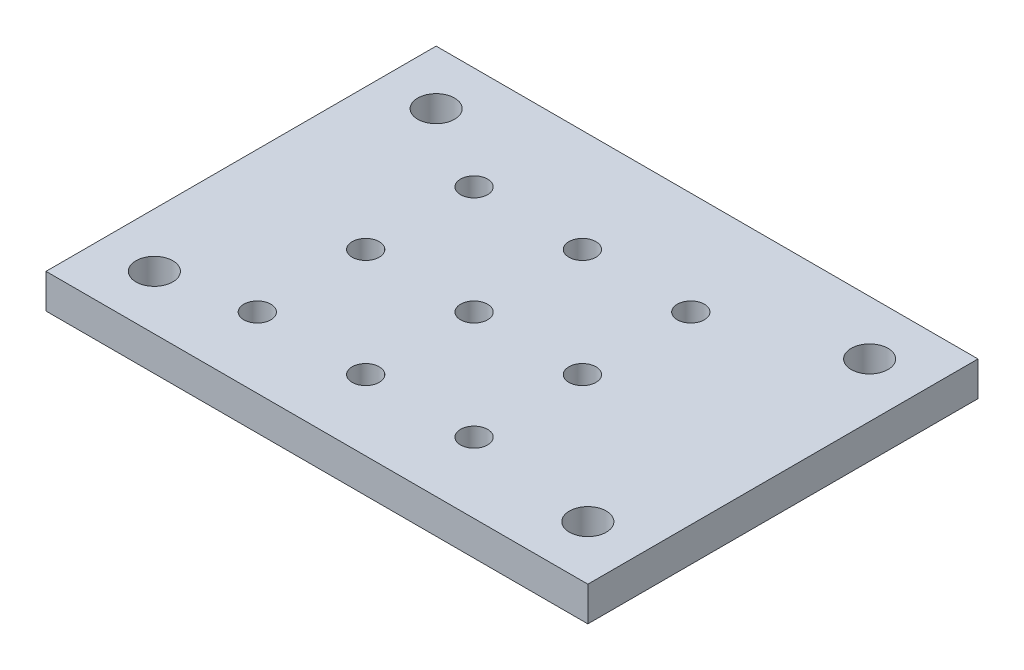
ISO-10303-21;
HEADER;
FILE_DESCRIPTION(('STEP AP214'),'2;1');
FILE_NAME('part.step','',(''),(''),'','','');
FILE_SCHEMA(('AUTOMOTIVE_DESIGN { 1 0 10303 214 1 1 1 1 }'));
ENDSEC;
DATA;
#1=APPLICATION_CONTEXT('core data for automotive mechanical design processes');
#2=APPLICATION_PROTOCOL_DEFINITION('international standard','automotive_design',2000,#1);
#3=PRODUCT_CONTEXT('',#1,'mechanical');
#4=PRODUCT('Part','Part','',(#3));
#5=PRODUCT_RELATED_PRODUCT_CATEGORY('part','',(#4));
#6=PRODUCT_DEFINITION_FORMATION('','',#4);
#7=PRODUCT_DEFINITION_CONTEXT('part definition',#1,'design');
#8=PRODUCT_DEFINITION('design','',#6,#7);
#9=PRODUCT_DEFINITION_SHAPE('','',#8);
#10=(LENGTH_UNIT() NAMED_UNIT(*) SI_UNIT(.MILLI.,.METRE.));
#11=(NAMED_UNIT(*) PLANE_ANGLE_UNIT() SI_UNIT($,.RADIAN.));
#12=(NAMED_UNIT(*) SI_UNIT($,.STERADIAN.) SOLID_ANGLE_UNIT());
#13=UNCERTAINTY_MEASURE_WITH_UNIT(LENGTH_MEASURE(1.E-05),#10,'distance_accuracy_value','');
#14=(GEOMETRIC_REPRESENTATION_CONTEXT(3) GLOBAL_UNCERTAINTY_ASSIGNED_CONTEXT((#13)) GLOBAL_UNIT_ASSIGNED_CONTEXT((#10,
#11,#12)) REPRESENTATION_CONTEXT('',''));
#15=CARTESIAN_POINT('',(0.,0.,0.));
#16=DIRECTION('',(0.,0.,1.));
#17=DIRECTION('',(1.,0.,0.));
#18=AXIS2_PLACEMENT_3D('',#15,#16,#17);
#19=CARTESIAN_POINT('',(0.,3.175,0.));
#20=DIRECTION('',(0.,0.,-1.));
#21=DIRECTION('',(-1.,0.,0.));
#22=AXIS2_PLACEMENT_3D('',#19,#20,#21);
#23=PLANE('',#22);
#24=DIRECTION('',(1.,0.,0.));
#25=VECTOR('',#24,1.);
#26=CARTESIAN_POINT('',(0.,0.,0.));
#27=LINE('',#26,#25);
#28=CARTESIAN_POINT('',(0.,0.,0.));
#29=VERTEX_POINT('',#28);
#30=CARTESIAN_POINT('',(50.,0.,0.));
#31=VERTEX_POINT('',#30);
#32=EDGE_CURVE('E168',#29,#31,#27,.T.);
#33=ORIENTED_EDGE('',*,*,#32,.T.);
#34=DIRECTION('',(0.,-1.,0.));
#35=VECTOR('',#34,1.);
#36=CARTESIAN_POINT('',(50.,3.175,0.));
#37=LINE('',#36,#35);
#38=CARTESIAN_POINT('',(50.,3.175,0.));
#39=VERTEX_POINT('',#38);
#40=EDGE_CURVE('E11',#39,#31,#37,.T.);
#41=ORIENTED_EDGE('',*,*,#40,.F.);
#42=DIRECTION('',(1.,0.,0.));
#43=VECTOR('',#42,1.);
#44=CARTESIAN_POINT('',(0.,3.175,0.));
#45=LINE('',#44,#43);
#46=CARTESIAN_POINT('',(0.,3.175,0.));
#47=VERTEX_POINT('',#46);
#48=EDGE_CURVE('E98',#47,#39,#45,.T.);
#49=ORIENTED_EDGE('',*,*,#48,.F.);
#50=DIRECTION('',(0.,-1.,0.));
#51=VECTOR('',#50,1.);
#52=CARTESIAN_POINT('',(0.,3.175,0.));
#53=LINE('',#52,#51);
#54=EDGE_CURVE('E65',#47,#29,#53,.T.);
#55=ORIENTED_EDGE('',*,*,#54,.T.);
#56=EDGE_LOOP('',(#33,#41,#49,#55));
#57=FACE_BOUND('',#56,.T.);
#58=ADVANCED_FACE('F47',(#57),#23,.F.);
#59=CARTESIAN_POINT('',(50.,3.175,0.));
#60=DIRECTION('',(-1.,0.,0.));
#61=DIRECTION('',(0.,0.,1.));
#62=AXIS2_PLACEMENT_3D('',#59,#60,#61);
#63=PLANE('',#62);
#64=DIRECTION('',(0.,0.,-1.));
#65=VECTOR('',#64,1.);
#66=CARTESIAN_POINT('',(50.,0.,0.));
#67=LINE('',#66,#65);
#68=CARTESIAN_POINT('',(50.,0.,-36.));
#69=VERTEX_POINT('',#68);
#70=EDGE_CURVE('E104',#31,#69,#67,.T.);
#71=ORIENTED_EDGE('',*,*,#70,.T.);
#72=DIRECTION('',(0.,-1.,0.));
#73=VECTOR('',#72,1.);
#74=CARTESIAN_POINT('',(50.,3.175,-36.));
#75=LINE('',#74,#73);
#76=CARTESIAN_POINT('',(50.,3.175,-36.));
#77=VERTEX_POINT('',#76);
#78=EDGE_CURVE('E57',#77,#69,#75,.T.);
#79=ORIENTED_EDGE('',*,*,#78,.F.);
#80=DIRECTION('',(0.,0.,-1.));
#81=VECTOR('',#80,1.);
#82=CARTESIAN_POINT('',(50.,3.175,0.));
#83=LINE('',#82,#81);
#84=EDGE_CURVE('E90',#39,#77,#83,.T.);
#85=ORIENTED_EDGE('',*,*,#84,.F.);
#86=ORIENTED_EDGE('',*,*,#40,.T.);
#87=EDGE_LOOP('',(#71,#79,#85,#86));
#88=FACE_BOUND('',#87,.T.);
#89=ADVANCED_FACE('F103',(#88),#63,.F.);
#90=CARTESIAN_POINT('',(0.,3.175,-36.));
#91=DIRECTION('',(0.,0.,-1.));
#92=DIRECTION('',(-1.,0.,0.));
#93=AXIS2_PLACEMENT_3D('',#90,#91,#92);
#94=PLANE('',#93);
#95=DIRECTION('',(1.,0.,0.));
#96=VECTOR('',#95,1.);
#97=CARTESIAN_POINT('',(0.,0.,-36.));
#98=LINE('',#97,#96);
#99=CARTESIAN_POINT('',(0.,0.,-36.));
#100=VERTEX_POINT('',#99);
#101=EDGE_CURVE('E173',#100,#69,#98,.T.);
#102=ORIENTED_EDGE('',*,*,#101,.F.);
#103=DIRECTION('',(0.,-1.,0.));
#104=VECTOR('',#103,1.);
#105=CARTESIAN_POINT('',(0.,3.175,-36.));
#106=LINE('',#105,#104);
#107=CARTESIAN_POINT('',(0.,3.175,-36.));
#108=VERTEX_POINT('',#107);
#109=EDGE_CURVE('E79',#108,#100,#106,.T.);
#110=ORIENTED_EDGE('',*,*,#109,.F.);
#111=DIRECTION('',(1.,0.,0.));
#112=VECTOR('',#111,1.);
#113=CARTESIAN_POINT('',(0.,3.175,-36.));
#114=LINE('',#113,#112);
#115=EDGE_CURVE('E97',#108,#77,#114,.T.);
#116=ORIENTED_EDGE('',*,*,#115,.T.);
#117=ORIENTED_EDGE('',*,*,#78,.T.);
#118=EDGE_LOOP('',(#102,#110,#116,#117));
#119=FACE_BOUND('',#118,.T.);
#120=ADVANCED_FACE('F108',(#119),#94,.T.);
#121=CARTESIAN_POINT('',(13.,3.175,-6.5));
#122=DIRECTION('',(0.,-1.,0.));
#123=DIRECTION('',(0.,0.,-1.));
#124=AXIS2_PLACEMENT_3D('',#121,#122,#123);
#125=CYLINDRICAL_SURFACE('',#124,1.25);
#126=CARTESIAN_POINT('',(13.,3.175,-6.5));
#127=DIRECTION('',(0.,1.,0.));
#128=DIRECTION('',(0.,0.,1.));
#129=AXIS2_PLACEMENT_3D('',#126,#127,#128);
#130=CIRCLE('',#129,1.25);
#131=CARTESIAN_POINT('',(13.,3.175,-5.24999999999999));
#132=VERTEX_POINT('',#131);
#133=EDGE_CURVE('E235',#132,#132,#130,.T.);
#134=ORIENTED_EDGE('',*,*,#133,.T.);
#135=EDGE_LOOP('',(#134));
#136=FACE_BOUND('',#135,.T.);
#137=CARTESIAN_POINT('',(13.,0.,-6.5));
#138=DIRECTION('',(0.,1.,0.));
#139=DIRECTION('',(0.,0.,1.));
#140=AXIS2_PLACEMENT_3D('',#137,#138,#139);
#141=CIRCLE('',#140,1.25);
#142=CARTESIAN_POINT('',(13.,0.,-5.24999999999999));
#143=VERTEX_POINT('',#142);
#144=EDGE_CURVE('E164',#143,#143,#141,.T.);
#145=ORIENTED_EDGE('',*,*,#144,.F.);
#146=EDGE_LOOP('',(#145));
#147=FACE_BOUND('',#146,.T.);
#148=ADVANCED_FACE('F241',(#136,#147),#125,.F.);
#149=CARTESIAN_POINT('',(5.,3.175,-5.));
#150=DIRECTION('',(0.,-1.,0.));
#151=DIRECTION('',(0.,0.,-1.));
#152=AXIS2_PLACEMENT_3D('',#149,#150,#151);
#153=CYLINDRICAL_SURFACE('',#152,1.7);
#154=CARTESIAN_POINT('',(5.,3.175,-5.));
#155=DIRECTION('',(0.,1.,0.));
#156=DIRECTION('',(0.,0.,1.));
#157=AXIS2_PLACEMENT_3D('',#154,#155,#156);
#158=CIRCLE('',#157,1.7);
#159=CARTESIAN_POINT('',(5.,3.175,-3.3));
#160=VERTEX_POINT('',#159);
#161=EDGE_CURVE('E231',#160,#160,#158,.T.);
#162=ORIENTED_EDGE('',*,*,#161,.T.);
#163=EDGE_LOOP('',(#162));
#164=FACE_BOUND('',#163,.T.);
#165=CARTESIAN_POINT('',(5.,0.,-5.));
#166=DIRECTION('',(0.,1.,0.));
#167=DIRECTION('',(0.,0.,1.));
#168=AXIS2_PLACEMENT_3D('',#165,#166,#167);
#169=CIRCLE('',#168,1.7);
#170=CARTESIAN_POINT('',(5.,0.,-3.3));
#171=VERTEX_POINT('',#170);
#172=EDGE_CURVE('E160',#171,#171,#169,.T.);
#173=ORIENTED_EDGE('',*,*,#172,.F.);
#174=EDGE_LOOP('',(#173));
#175=FACE_BOUND('',#174,.T.);
#176=ADVANCED_FACE('F267',(#164,#175),#153,.F.);
#177=CARTESIAN_POINT('',(5.,3.175,-31.));
#178=DIRECTION('',(0.,-1.,0.));
#179=DIRECTION('',(0.,0.,-1.));
#180=AXIS2_PLACEMENT_3D('',#177,#178,#179);
#181=CYLINDRICAL_SURFACE('',#180,1.7);
#182=CARTESIAN_POINT('',(5.,3.175,-31.));
#183=DIRECTION('',(0.,1.,0.));
#184=DIRECTION('',(0.,0.,1.));
#185=AXIS2_PLACEMENT_3D('',#182,#183,#184);
#186=CIRCLE('',#185,1.7);
#187=CARTESIAN_POINT('',(5.,3.175,-29.3));
#188=VERTEX_POINT('',#187);
#189=EDGE_CURVE('E227',#188,#188,#186,.T.);
#190=ORIENTED_EDGE('',*,*,#189,.T.);
#191=EDGE_LOOP('',(#190));
#192=FACE_BOUND('',#191,.T.);
#193=CARTESIAN_POINT('',(5.,0.,-31.));
#194=DIRECTION('',(0.,1.,0.));
#195=DIRECTION('',(0.,0.,1.));
#196=AXIS2_PLACEMENT_3D('',#193,#194,#195);
#197=CIRCLE('',#196,1.7);
#198=CARTESIAN_POINT('',(5.,0.,-29.3));
#199=VERTEX_POINT('',#198);
#200=EDGE_CURVE('E156',#199,#199,#197,.T.);
#201=ORIENTED_EDGE('',*,*,#200,.F.);
#202=EDGE_LOOP('',(#201));
#203=FACE_BOUND('',#202,.T.);
#204=ADVANCED_FACE('F270',(#192,#203),#181,.F.);
#205=CARTESIAN_POINT('',(45.,3.175,-31.));
#206=DIRECTION('',(0.,-1.,0.));
#207=DIRECTION('',(0.,0.,-1.));
#208=AXIS2_PLACEMENT_3D('',#205,#206,#207);
#209=CYLINDRICAL_SURFACE('',#208,1.7);
#210=CARTESIAN_POINT('',(45.,3.175,-31.));
#211=DIRECTION('',(0.,1.,0.));
#212=DIRECTION('',(0.,0.,1.));
#213=AXIS2_PLACEMENT_3D('',#210,#211,#212);
#214=CIRCLE('',#213,1.7);
#215=CARTESIAN_POINT('',(45.,3.175,-29.3));
#216=VERTEX_POINT('',#215);
#217=EDGE_CURVE('E223',#216,#216,#214,.T.);
#218=ORIENTED_EDGE('',*,*,#217,.T.);
#219=EDGE_LOOP('',(#218));
#220=FACE_BOUND('',#219,.T.);
#221=CARTESIAN_POINT('',(45.,0.,-31.));
#222=DIRECTION('',(0.,1.,0.));
#223=DIRECTION('',(0.,0.,1.));
#224=AXIS2_PLACEMENT_3D('',#221,#222,#223);
#225=CIRCLE('',#224,1.7);
#226=CARTESIAN_POINT('',(45.,0.,-29.3));
#227=VERTEX_POINT('',#226);
#228=EDGE_CURVE('E152',#227,#227,#225,.T.);
#229=ORIENTED_EDGE('',*,*,#228,.F.);
#230=EDGE_LOOP('',(#229));
#231=FACE_BOUND('',#230,.T.);
#232=ADVANCED_FACE('F274',(#220,#231),#209,.F.);
#233=CARTESIAN_POINT('',(45.,3.175,-5.));
#234=DIRECTION('',(0.,-1.,0.));
#235=DIRECTION('',(0.,0.,-1.));
#236=AXIS2_PLACEMENT_3D('',#233,#234,#235);
#237=CYLINDRICAL_SURFACE('',#236,1.7);
#238=CARTESIAN_POINT('',(45.,3.175,-5.));
#239=DIRECTION('',(0.,1.,0.));
#240=DIRECTION('',(0.,0.,1.));
#241=AXIS2_PLACEMENT_3D('',#238,#239,#240);
#242=CIRCLE('',#241,1.7);
#243=CARTESIAN_POINT('',(45.,3.175,-3.3));
#244=VERTEX_POINT('',#243);
#245=EDGE_CURVE('E219',#244,#244,#242,.T.);
#246=ORIENTED_EDGE('',*,*,#245,.T.);
#247=EDGE_LOOP('',(#246));
#248=FACE_BOUND('',#247,.T.);
#249=CARTESIAN_POINT('',(45.,0.,-5.));
#250=DIRECTION('',(0.,1.,0.));
#251=DIRECTION('',(0.,0.,1.));
#252=AXIS2_PLACEMENT_3D('',#249,#250,#251);
#253=CIRCLE('',#252,1.7);
#254=CARTESIAN_POINT('',(45.,0.,-3.3));
#255=VERTEX_POINT('',#254);
#256=EDGE_CURVE('E148',#255,#255,#253,.T.);
#257=ORIENTED_EDGE('',*,*,#256,.F.);
#258=EDGE_LOOP('',(#257));
#259=FACE_BOUND('',#258,.T.);
#260=ADVANCED_FACE('F278',(#248,#259),#237,.F.);
#261=CARTESIAN_POINT('',(23.,3.175,-6.5));
#262=DIRECTION('',(0.,-1.,0.));
#263=DIRECTION('',(0.,0.,-1.));
#264=AXIS2_PLACEMENT_3D('',#261,#262,#263);
#265=CYLINDRICAL_SURFACE('',#264,1.25);
#266=CARTESIAN_POINT('',(23.,3.175,-6.5));
#267=DIRECTION('',(0.,1.,0.));
#268=DIRECTION('',(0.,0.,1.));
#269=AXIS2_PLACEMENT_3D('',#266,#267,#268);
#270=CIRCLE('',#269,1.25);
#271=CARTESIAN_POINT('',(23.,3.175,-5.24999999999999));
#272=VERTEX_POINT('',#271);
#273=EDGE_CURVE('E215',#272,#272,#270,.T.);
#274=ORIENTED_EDGE('',*,*,#273,.T.);
#275=EDGE_LOOP('',(#274));
#276=FACE_BOUND('',#275,.T.);
#277=CARTESIAN_POINT('',(23.,0.,-6.5));
#278=DIRECTION('',(0.,1.,0.));
#279=DIRECTION('',(0.,0.,1.));
#280=AXIS2_PLACEMENT_3D('',#277,#278,#279);
#281=CIRCLE('',#280,1.25);
#282=CARTESIAN_POINT('',(23.,0.,-5.24999999999999));
#283=VERTEX_POINT('',#282);
#284=EDGE_CURVE('E144',#283,#283,#281,.T.);
#285=ORIENTED_EDGE('',*,*,#284,.F.);
#286=EDGE_LOOP('',(#285));
#287=FACE_BOUND('',#286,.T.);
#288=ADVANCED_FACE('F282',(#276,#287),#265,.F.);
#289=CARTESIAN_POINT('',(33.,3.175,-6.5));
#290=DIRECTION('',(0.,-1.,0.));
#291=DIRECTION('',(0.,0.,-1.));
#292=AXIS2_PLACEMENT_3D('',#289,#290,#291);
#293=CYLINDRICAL_SURFACE('',#292,1.25);
#294=CARTESIAN_POINT('',(33.,3.175,-6.5));
#295=DIRECTION('',(0.,1.,0.));
#296=DIRECTION('',(0.,0.,1.));
#297=AXIS2_PLACEMENT_3D('',#294,#295,#296);
#298=CIRCLE('',#297,1.25);
#299=CARTESIAN_POINT('',(33.,3.175,-5.24999999999999));
#300=VERTEX_POINT('',#299);
#301=EDGE_CURVE('E211',#300,#300,#298,.T.);
#302=ORIENTED_EDGE('',*,*,#301,.T.);
#303=EDGE_LOOP('',(#302));
#304=FACE_BOUND('',#303,.T.);
#305=CARTESIAN_POINT('',(33.,0.,-6.5));
#306=DIRECTION('',(0.,1.,0.));
#307=DIRECTION('',(0.,0.,1.));
#308=AXIS2_PLACEMENT_3D('',#305,#306,#307);
#309=CIRCLE('',#308,1.25);
#310=CARTESIAN_POINT('',(33.,0.,-5.24999999999999));
#311=VERTEX_POINT('',#310);
#312=EDGE_CURVE('E140',#311,#311,#309,.T.);
#313=ORIENTED_EDGE('',*,*,#312,.F.);
#314=EDGE_LOOP('',(#313));
#315=FACE_BOUND('',#314,.T.);
#316=ADVANCED_FACE('F286',(#304,#315),#293,.F.);
#317=CARTESIAN_POINT('',(23.,3.175,-16.5));
#318=DIRECTION('',(0.,-1.,0.));
#319=DIRECTION('',(0.,0.,-1.));
#320=AXIS2_PLACEMENT_3D('',#317,#318,#319);
#321=CYLINDRICAL_SURFACE('',#320,1.25);
#322=CARTESIAN_POINT('',(23.,3.175,-16.5));
#323=DIRECTION('',(0.,1.,0.));
#324=DIRECTION('',(0.,0.,1.));
#325=AXIS2_PLACEMENT_3D('',#322,#323,#324);
#326=CIRCLE('',#325,1.25);
#327=CARTESIAN_POINT('',(23.,3.175,-15.25));
#328=VERTEX_POINT('',#327);
#329=EDGE_CURVE('E207',#328,#328,#326,.T.);
#330=ORIENTED_EDGE('',*,*,#329,.T.);
#331=EDGE_LOOP('',(#330));
#332=FACE_BOUND('',#331,.T.);
#333=CARTESIAN_POINT('',(23.,0.,-16.5));
#334=DIRECTION('',(0.,1.,0.));
#335=DIRECTION('',(0.,0.,1.));
#336=AXIS2_PLACEMENT_3D('',#333,#334,#335);
#337=CIRCLE('',#336,1.25);
#338=CARTESIAN_POINT('',(23.,0.,-15.25));
#339=VERTEX_POINT('',#338);
#340=EDGE_CURVE('E136',#339,#339,#337,.T.);
#341=ORIENTED_EDGE('',*,*,#340,.F.);
#342=EDGE_LOOP('',(#341));
#343=FACE_BOUND('',#342,.T.);
#344=ADVANCED_FACE('F290',(#332,#343),#321,.F.);
#345=CARTESIAN_POINT('',(33.,3.175,-16.5));
#346=DIRECTION('',(0.,-1.,0.));
#347=DIRECTION('',(0.,0.,-1.));
#348=AXIS2_PLACEMENT_3D('',#345,#346,#347);
#349=CYLINDRICAL_SURFACE('',#348,1.25);
#350=CARTESIAN_POINT('',(33.,3.175,-16.5));
#351=DIRECTION('',(0.,1.,0.));
#352=DIRECTION('',(0.,0.,1.));
#353=AXIS2_PLACEMENT_3D('',#350,#351,#352);
#354=CIRCLE('',#353,1.25);
#355=CARTESIAN_POINT('',(33.,3.175,-15.25));
#356=VERTEX_POINT('',#355);
#357=EDGE_CURVE('E203',#356,#356,#354,.T.);
#358=ORIENTED_EDGE('',*,*,#357,.T.);
#359=EDGE_LOOP('',(#358));
#360=FACE_BOUND('',#359,.T.);
#361=CARTESIAN_POINT('',(33.,0.,-16.5));
#362=DIRECTION('',(0.,1.,0.));
#363=DIRECTION('',(0.,0.,1.));
#364=AXIS2_PLACEMENT_3D('',#361,#362,#363);
#365=CIRCLE('',#364,1.25);
#366=CARTESIAN_POINT('',(33.,0.,-15.25));
#367=VERTEX_POINT('',#366);
#368=EDGE_CURVE('E132',#367,#367,#365,.T.);
#369=ORIENTED_EDGE('',*,*,#368,.F.);
#370=EDGE_LOOP('',(#369));
#371=FACE_BOUND('',#370,.T.);
#372=ADVANCED_FACE('F294',(#360,#371),#349,.F.);
#373=CARTESIAN_POINT('',(22.9999999999999,3.175,-26.5));
#374=DIRECTION('',(0.,-1.,0.));
#375=DIRECTION('',(0.,0.,-1.));
#376=AXIS2_PLACEMENT_3D('',#373,#374,#375);
#377=CYLINDRICAL_SURFACE('',#376,1.25);
#378=CARTESIAN_POINT('',(22.9999999999999,3.175,-26.5));
#379=DIRECTION('',(0.,1.,0.));
#380=DIRECTION('',(0.,0.,1.));
#381=AXIS2_PLACEMENT_3D('',#378,#379,#380);
#382=CIRCLE('',#381,1.25);
#383=CARTESIAN_POINT('',(22.9999999999999,3.175,-25.25));
#384=VERTEX_POINT('',#383);
#385=EDGE_CURVE('E199',#384,#384,#382,.T.);
#386=ORIENTED_EDGE('',*,*,#385,.T.);
#387=EDGE_LOOP('',(#386));
#388=FACE_BOUND('',#387,.T.);
#389=CARTESIAN_POINT('',(22.9999999999999,0.,-26.5));
#390=DIRECTION('',(0.,1.,0.));
#391=DIRECTION('',(0.,0.,1.));
#392=AXIS2_PLACEMENT_3D('',#389,#390,#391);
#393=CIRCLE('',#392,1.25);
#394=CARTESIAN_POINT('',(22.9999999999999,0.,-25.25));
#395=VERTEX_POINT('',#394);
#396=EDGE_CURVE('E128',#395,#395,#393,.T.);
#397=ORIENTED_EDGE('',*,*,#396,.F.);
#398=EDGE_LOOP('',(#397));
#399=FACE_BOUND('',#398,.T.);
#400=ADVANCED_FACE('F298',(#388,#399),#377,.F.);
#401=CARTESIAN_POINT('',(32.9999999999999,3.175,-26.5));
#402=DIRECTION('',(0.,-1.,0.));
#403=DIRECTION('',(0.,0.,-1.));
#404=AXIS2_PLACEMENT_3D('',#401,#402,#403);
#405=CYLINDRICAL_SURFACE('',#404,1.25);
#406=CARTESIAN_POINT('',(32.9999999999999,3.175,-26.5));
#407=DIRECTION('',(0.,1.,0.));
#408=DIRECTION('',(0.,0.,1.));
#409=AXIS2_PLACEMENT_3D('',#406,#407,#408);
#410=CIRCLE('',#409,1.25);
#411=CARTESIAN_POINT('',(32.9999999999999,3.175,-25.25));
#412=VERTEX_POINT('',#411);
#413=EDGE_CURVE('E193',#412,#412,#410,.T.);
#414=ORIENTED_EDGE('',*,*,#413,.T.);
#415=EDGE_LOOP('',(#414));
#416=FACE_BOUND('',#415,.T.);
#417=CARTESIAN_POINT('',(32.9999999999999,0.,-26.5));
#418=DIRECTION('',(0.,1.,0.));
#419=DIRECTION('',(0.,0.,1.));
#420=AXIS2_PLACEMENT_3D('',#417,#418,#419);
#421=CIRCLE('',#420,1.25);
#422=CARTESIAN_POINT('',(32.9999999999999,0.,-25.25));
#423=VERTEX_POINT('',#422);
#424=EDGE_CURVE('E124',#423,#423,#421,.T.);
#425=ORIENTED_EDGE('',*,*,#424,.F.);
#426=EDGE_LOOP('',(#425));
#427=FACE_BOUND('',#426,.T.);
#428=ADVANCED_FACE('F302',(#416,#427),#405,.F.);
#429=CARTESIAN_POINT('',(13.,3.175,-16.5));
#430=DIRECTION('',(0.,-1.,0.));
#431=DIRECTION('',(0.,0.,-1.));
#432=AXIS2_PLACEMENT_3D('',#429,#430,#431);
#433=CYLINDRICAL_SURFACE('',#432,1.25);
#434=CARTESIAN_POINT('',(13.,3.175,-16.5));
#435=DIRECTION('',(0.,1.,0.));
#436=DIRECTION('',(0.,0.,1.));
#437=AXIS2_PLACEMENT_3D('',#434,#435,#436);
#438=CIRCLE('',#437,1.25);
#439=CARTESIAN_POINT('',(13.,3.175,-15.25));
#440=VERTEX_POINT('',#439);
#441=EDGE_CURVE('E187',#440,#440,#438,.T.);
#442=ORIENTED_EDGE('',*,*,#441,.T.);
#443=EDGE_LOOP('',(#442));
#444=FACE_BOUND('',#443,.T.);
#445=CARTESIAN_POINT('',(13.,0.,-16.5));
#446=DIRECTION('',(0.,1.,0.));
#447=DIRECTION('',(0.,0.,1.));
#448=AXIS2_PLACEMENT_3D('',#445,#446,#447);
#449=CIRCLE('',#448,1.25);
#450=CARTESIAN_POINT('',(13.,0.,-15.25));
#451=VERTEX_POINT('',#450);
#452=EDGE_CURVE('E120',#451,#451,#449,.T.);
#453=ORIENTED_EDGE('',*,*,#452,.F.);
#454=EDGE_LOOP('',(#453));
#455=FACE_BOUND('',#454,.T.);
#456=ADVANCED_FACE('F305',(#444,#455),#433,.F.);
#457=CARTESIAN_POINT('',(12.9999999999999,3.175,-26.5));
#458=DIRECTION('',(0.,-1.,0.));
#459=DIRECTION('',(0.,0.,-1.));
#460=AXIS2_PLACEMENT_3D('',#457,#458,#459);
#461=CYLINDRICAL_SURFACE('',#460,1.25);
#462=CARTESIAN_POINT('',(12.9999999999999,3.175,-26.5));
#463=DIRECTION('',(0.,1.,0.));
#464=DIRECTION('',(0.,0.,1.));
#465=AXIS2_PLACEMENT_3D('',#462,#463,#464);
#466=CIRCLE('',#465,1.25);
#467=CARTESIAN_POINT('',(12.9999999999999,3.175,-25.25));
#468=VERTEX_POINT('',#467);
#469=EDGE_CURVE('E180',#468,#468,#466,.T.);
#470=ORIENTED_EDGE('',*,*,#469,.T.);
#471=EDGE_LOOP('',(#470));
#472=FACE_BOUND('',#471,.T.);
#473=CARTESIAN_POINT('',(12.9999999999999,0.,-26.5));
#474=DIRECTION('',(0.,1.,0.));
#475=DIRECTION('',(0.,0.,1.));
#476=AXIS2_PLACEMENT_3D('',#473,#474,#475);
#477=CIRCLE('',#476,1.25);
#478=CARTESIAN_POINT('',(12.9999999999999,0.,-25.25));
#479=VERTEX_POINT('',#478);
#480=EDGE_CURVE('E116',#479,#479,#477,.T.);
#481=ORIENTED_EDGE('',*,*,#480,.F.);
#482=EDGE_LOOP('',(#481));
#483=FACE_BOUND('',#482,.T.);
#484=ADVANCED_FACE('F49',(#472,#483),#461,.F.);
#485=CARTESIAN_POINT('',(0.,3.175,0.));
#486=DIRECTION('',(-1.,0.,0.));
#487=DIRECTION('',(0.,0.,1.));
#488=AXIS2_PLACEMENT_3D('',#485,#486,#487);
#489=PLANE('',#488);
#490=DIRECTION('',(0.,0.,-1.));
#491=VECTOR('',#490,1.);
#492=CARTESIAN_POINT('',(0.,0.,0.));
#493=LINE('',#492,#491);
#494=EDGE_CURVE('E176',#29,#100,#493,.T.);
#495=ORIENTED_EDGE('',*,*,#494,.F.);
#496=ORIENTED_EDGE('',*,*,#54,.F.);
#497=DIRECTION('',(0.,0.,-1.));
#498=VECTOR('',#497,1.);
#499=CARTESIAN_POINT('',(0.,3.175,0.));
#500=LINE('',#499,#498);
#501=EDGE_CURVE('E110',#47,#108,#500,.T.);
#502=ORIENTED_EDGE('',*,*,#501,.T.);
#503=ORIENTED_EDGE('',*,*,#109,.T.);
#504=EDGE_LOOP('',(#495,#496,#502,#503));
#505=FACE_BOUND('',#504,.T.);
#506=ADVANCED_FACE('F246',(#505),#489,.T.);
#507=CARTESIAN_POINT('',(0.,3.175,0.));
#508=DIRECTION('',(0.,1.,0.));
#509=DIRECTION('',(0.,0.,1.));
#510=AXIS2_PLACEMENT_3D('',#507,#508,#509);
#511=PLANE('',#510);
#512=ORIENTED_EDGE('',*,*,#469,.F.);
#513=EDGE_LOOP('',(#512));
#514=FACE_BOUND('',#513,.T.);
#515=ORIENTED_EDGE('',*,*,#441,.F.);
#516=EDGE_LOOP('',(#515));
#517=FACE_BOUND('',#516,.T.);
#518=ORIENTED_EDGE('',*,*,#413,.F.);
#519=EDGE_LOOP('',(#518));
#520=FACE_BOUND('',#519,.T.);
#521=ORIENTED_EDGE('',*,*,#385,.F.);
#522=EDGE_LOOP('',(#521));
#523=FACE_BOUND('',#522,.T.);
#524=ORIENTED_EDGE('',*,*,#357,.F.);
#525=EDGE_LOOP('',(#524));
#526=FACE_BOUND('',#525,.T.);
#527=ORIENTED_EDGE('',*,*,#329,.F.);
#528=EDGE_LOOP('',(#527));
#529=FACE_BOUND('',#528,.T.);
#530=ORIENTED_EDGE('',*,*,#301,.F.);
#531=EDGE_LOOP('',(#530));
#532=FACE_BOUND('',#531,.T.);
#533=ORIENTED_EDGE('',*,*,#273,.F.);
#534=EDGE_LOOP('',(#533));
#535=FACE_BOUND('',#534,.T.);
#536=ORIENTED_EDGE('',*,*,#245,.F.);
#537=EDGE_LOOP('',(#536));
#538=FACE_BOUND('',#537,.T.);
#539=ORIENTED_EDGE('',*,*,#217,.F.);
#540=EDGE_LOOP('',(#539));
#541=FACE_BOUND('',#540,.T.);
#542=ORIENTED_EDGE('',*,*,#189,.F.);
#543=EDGE_LOOP('',(#542));
#544=FACE_BOUND('',#543,.T.);
#545=ORIENTED_EDGE('',*,*,#161,.F.);
#546=EDGE_LOOP('',(#545));
#547=FACE_BOUND('',#546,.T.);
#548=ORIENTED_EDGE('',*,*,#133,.F.);
#549=EDGE_LOOP('',(#548));
#550=FACE_BOUND('',#549,.T.);
#551=ORIENTED_EDGE('',*,*,#48,.T.);
#552=ORIENTED_EDGE('',*,*,#84,.T.);
#553=ORIENTED_EDGE('',*,*,#115,.F.);
#554=ORIENTED_EDGE('',*,*,#501,.F.);
#555=EDGE_LOOP('',(#551,#552,#553,#554));
#556=FACE_BOUND('',#555,.T.);
#557=ADVANCED_FACE('F94',(#514,#517,#520,#523,#526,#529,#532,#535,#538,#541,#544,#547,#550,
#556),#511,.T.);
#558=CARTESIAN_POINT('',(0.,0.,0.));
#559=DIRECTION('',(0.,1.,0.));
#560=DIRECTION('',(0.,0.,1.));
#561=AXIS2_PLACEMENT_3D('',#558,#559,#560);
#562=PLANE('',#561);
#563=ORIENTED_EDGE('',*,*,#480,.T.);
#564=EDGE_LOOP('',(#563));
#565=FACE_BOUND('',#564,.T.);
#566=ORIENTED_EDGE('',*,*,#452,.T.);
#567=EDGE_LOOP('',(#566));
#568=FACE_BOUND('',#567,.T.);
#569=ORIENTED_EDGE('',*,*,#424,.T.);
#570=EDGE_LOOP('',(#569));
#571=FACE_BOUND('',#570,.T.);
#572=ORIENTED_EDGE('',*,*,#396,.T.);
#573=EDGE_LOOP('',(#572));
#574=FACE_BOUND('',#573,.T.);
#575=ORIENTED_EDGE('',*,*,#368,.T.);
#576=EDGE_LOOP('',(#575));
#577=FACE_BOUND('',#576,.T.);
#578=ORIENTED_EDGE('',*,*,#340,.T.);
#579=EDGE_LOOP('',(#578));
#580=FACE_BOUND('',#579,.T.);
#581=ORIENTED_EDGE('',*,*,#312,.T.);
#582=EDGE_LOOP('',(#581));
#583=FACE_BOUND('',#582,.T.);
#584=ORIENTED_EDGE('',*,*,#284,.T.);
#585=EDGE_LOOP('',(#584));
#586=FACE_BOUND('',#585,.T.);
#587=ORIENTED_EDGE('',*,*,#256,.T.);
#588=EDGE_LOOP('',(#587));
#589=FACE_BOUND('',#588,.T.);
#590=ORIENTED_EDGE('',*,*,#228,.T.);
#591=EDGE_LOOP('',(#590));
#592=FACE_BOUND('',#591,.T.);
#593=ORIENTED_EDGE('',*,*,#200,.T.);
#594=EDGE_LOOP('',(#593));
#595=FACE_BOUND('',#594,.T.);
#596=ORIENTED_EDGE('',*,*,#172,.T.);
#597=EDGE_LOOP('',(#596));
#598=FACE_BOUND('',#597,.T.);
#599=ORIENTED_EDGE('',*,*,#144,.T.);
#600=EDGE_LOOP('',(#599));
#601=FACE_BOUND('',#600,.T.);
#602=ORIENTED_EDGE('',*,*,#32,.F.);
#603=ORIENTED_EDGE('',*,*,#494,.T.);
#604=ORIENTED_EDGE('',*,*,#101,.T.);
#605=ORIENTED_EDGE('',*,*,#70,.F.);
#606=EDGE_LOOP('',(#602,#603,#604,#605));
#607=FACE_BOUND('',#606,.T.);
#608=ADVANCED_FACE('F245',(#565,#568,#571,#574,#577,#580,#583,#586,#589,#592,#595,#598,#601,
#607),#562,.F.);
#609=CLOSED_SHELL('',(#58,#89,#120,#148,#176,#204,#232,#260,#288,#316,#344,#372,#400,#428,#456,
#484,#506,#557,#608));
#610=MANIFOLD_SOLID_BREP('B2',#609);
#611=ADVANCED_BREP_SHAPE_REPRESENTATION('',(#18,#610),#14);
#612=SHAPE_DEFINITION_REPRESENTATION(#9,#611);
ENDSEC;
END-ISO-10303-21;
